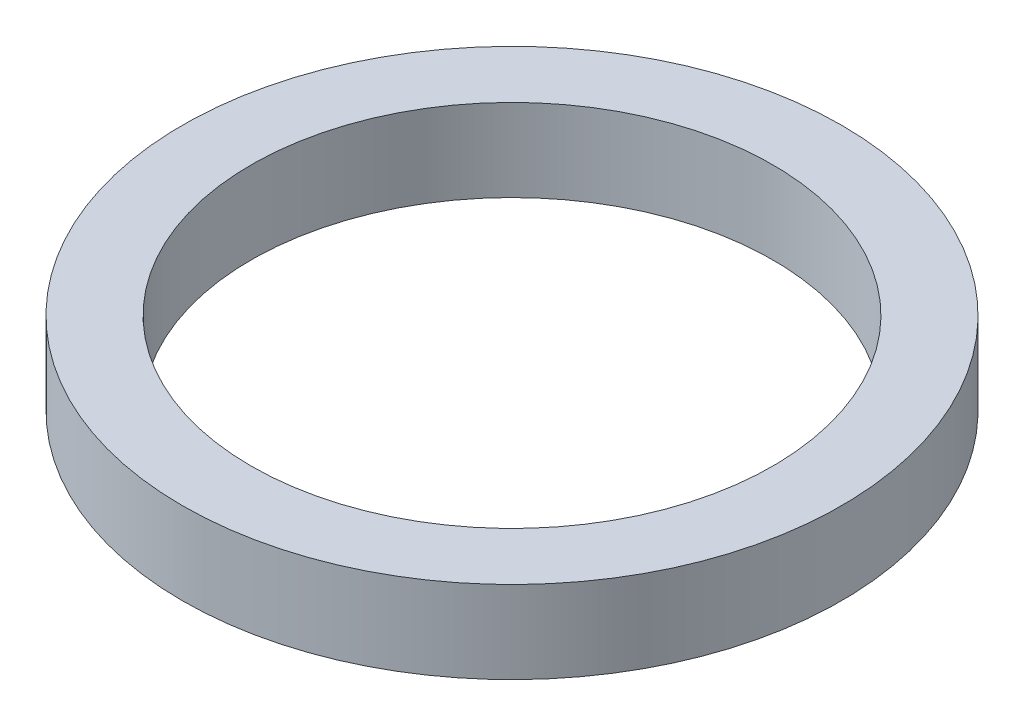
ISO-10303-21;
HEADER;
FILE_DESCRIPTION(('STEP AP214'),'2;1');
FILE_NAME('part.step','',(''),(''),'','','');
FILE_SCHEMA(('AUTOMOTIVE_DESIGN { 1 0 10303 214 1 1 1 1 }'));
ENDSEC;
DATA;
#1=APPLICATION_CONTEXT('core data for automotive mechanical design processes');
#2=APPLICATION_PROTOCOL_DEFINITION('international standard','automotive_design',2000,#1);
#3=PRODUCT_CONTEXT('',#1,'mechanical');
#4=PRODUCT('Part','Part','',(#3));
#5=PRODUCT_RELATED_PRODUCT_CATEGORY('part','',(#4));
#6=PRODUCT_DEFINITION_FORMATION('','',#4);
#7=PRODUCT_DEFINITION_CONTEXT('part definition',#1,'design');
#8=PRODUCT_DEFINITION('design','',#6,#7);
#9=PRODUCT_DEFINITION_SHAPE('','',#8);
#10=(LENGTH_UNIT() NAMED_UNIT(*) SI_UNIT(.MILLI.,.METRE.));
#11=(NAMED_UNIT(*) PLANE_ANGLE_UNIT() SI_UNIT($,.RADIAN.));
#12=(NAMED_UNIT(*) SI_UNIT($,.STERADIAN.) SOLID_ANGLE_UNIT());
#13=UNCERTAINTY_MEASURE_WITH_UNIT(LENGTH_MEASURE(1.E-05),#10,'distance_accuracy_value','');
#14=(GEOMETRIC_REPRESENTATION_CONTEXT(3) GLOBAL_UNCERTAINTY_ASSIGNED_CONTEXT((#13)) GLOBAL_UNIT_ASSIGNED_CONTEXT((#10,
#11,#12)) REPRESENTATION_CONTEXT('',''));
#15=CARTESIAN_POINT('',(0.,0.,0.));
#16=DIRECTION('',(0.,0.,1.));
#17=DIRECTION('',(1.,0.,0.));
#18=AXIS2_PLACEMENT_3D('',#15,#16,#17);
#19=CARTESIAN_POINT('',(0.,15.,0.));
#20=DIRECTION('',(0.,-1.,0.));
#21=DIRECTION('',(0.,0.,-1.));
#22=AXIS2_PLACEMENT_3D('',#19,#20,#21);
#23=CYLINDRICAL_SURFACE('',#22,60.);
#24=CARTESIAN_POINT('',(0.,15.,0.));
#25=DIRECTION('',(0.,1.,0.));
#26=DIRECTION('',(0.,0.,1.));
#27=AXIS2_PLACEMENT_3D('',#24,#25,#26);
#28=CIRCLE('',#27,60.);
#29=CARTESIAN_POINT('',(0.,15.,60.));
#30=VERTEX_POINT('',#29);
#31=EDGE_CURVE('E10',#30,#30,#28,.T.);
#32=ORIENTED_EDGE('',*,*,#31,.F.);
#33=EDGE_LOOP('',(#32));
#34=FACE_BOUND('',#33,.T.);
#35=CARTESIAN_POINT('',(0.,0.,0.));
#36=DIRECTION('',(0.,1.,0.));
#37=DIRECTION('',(0.,0.,1.));
#38=AXIS2_PLACEMENT_3D('',#35,#36,#37);
#39=CIRCLE('',#38,60.);
#40=CARTESIAN_POINT('',(0.,0.,60.));
#41=VERTEX_POINT('',#40);
#42=EDGE_CURVE('E37',#41,#41,#39,.T.);
#43=ORIENTED_EDGE('',*,*,#42,.T.);
#44=EDGE_LOOP('',(#43));
#45=FACE_BOUND('',#44,.T.);
#46=ADVANCED_FACE('F40',(#34,#45),#23,.T.);
#47=CARTESIAN_POINT('',(0.,15.,0.));
#48=DIRECTION('',(0.,1.,0.));
#49=DIRECTION('',(0.,0.,1.));
#50=AXIS2_PLACEMENT_3D('',#47,#48,#49);
#51=PLANE('',#50);
#52=CARTESIAN_POINT('',(0.,15.,0.));
#53=DIRECTION('',(0.,1.,0.));
#54=DIRECTION('',(0.,0.,1.));
#55=AXIS2_PLACEMENT_3D('',#52,#53,#54);
#56=CIRCLE('',#55,47.5);
#57=CARTESIAN_POINT('',(0.,15.,47.5));
#58=VERTEX_POINT('',#57);
#59=EDGE_CURVE('E50',#58,#58,#56,.T.);
#60=ORIENTED_EDGE('',*,*,#59,.F.);
#61=EDGE_LOOP('',(#60));
#62=FACE_BOUND('',#61,.T.);
#63=ORIENTED_EDGE('',*,*,#31,.T.);
#64=EDGE_LOOP('',(#63));
#65=FACE_BOUND('',#64,.T.);
#66=ADVANCED_FACE('F59',(#62,#65),#51,.T.);
#67=CARTESIAN_POINT('',(0.,0.,0.));
#68=DIRECTION('',(0.,1.,0.));
#69=DIRECTION('',(0.,0.,1.));
#70=AXIS2_PLACEMENT_3D('',#67,#68,#69);
#71=PLANE('',#70);
#72=CARTESIAN_POINT('',(0.,0.,0.));
#73=DIRECTION('',(0.,1.,0.));
#74=DIRECTION('',(0.,0.,1.));
#75=AXIS2_PLACEMENT_3D('',#72,#73,#74);
#76=CIRCLE('',#75,47.5);
#77=CARTESIAN_POINT('',(0.,0.,47.5));
#78=VERTEX_POINT('',#77);
#79=EDGE_CURVE('E47',#78,#78,#76,.T.);
#80=ORIENTED_EDGE('',*,*,#79,.T.);
#81=EDGE_LOOP('',(#80));
#82=FACE_BOUND('',#81,.T.);
#83=ORIENTED_EDGE('',*,*,#42,.F.);
#84=EDGE_LOOP('',(#83));
#85=FACE_BOUND('',#84,.T.);
#86=ADVANCED_FACE('F58',(#82,#85),#71,.F.);
#87=CARTESIAN_POINT('',(0.,15.,0.));
#88=DIRECTION('',(0.,-1.,0.));
#89=DIRECTION('',(0.,0.,-1.));
#90=AXIS2_PLACEMENT_3D('',#87,#88,#89);
#91=CYLINDRICAL_SURFACE('',#90,47.5);
#92=ORIENTED_EDGE('',*,*,#59,.T.);
#93=EDGE_LOOP('',(#92));
#94=FACE_BOUND('',#93,.T.);
#95=ORIENTED_EDGE('',*,*,#79,.F.);
#96=EDGE_LOOP('',(#95));
#97=FACE_BOUND('',#96,.T.);
#98=ADVANCED_FACE('F54',(#94,#97),#91,.F.);
#99=CLOSED_SHELL('',(#46,#66,#86,#98));
#100=MANIFOLD_SOLID_BREP('B2',#99);
#101=ADVANCED_BREP_SHAPE_REPRESENTATION('',(#18,#100),#14);
#102=SHAPE_DEFINITION_REPRESENTATION(#9,#101);
ENDSEC;
END-ISO-10303-21;
